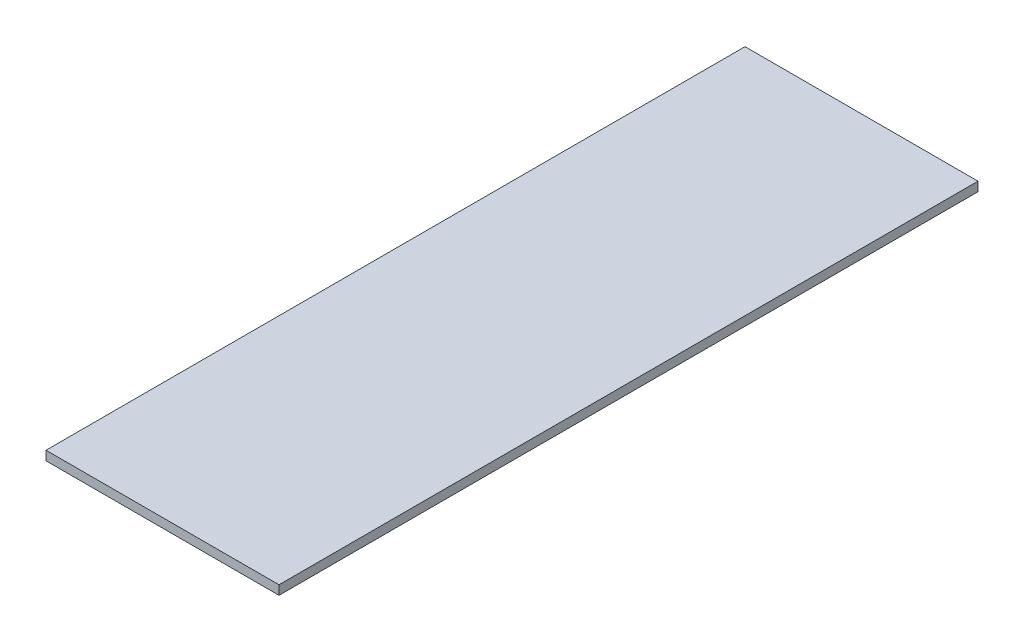
ISO-10303-21;
HEADER;
FILE_DESCRIPTION(('STEP AP214'),'2;1');
FILE_NAME('part.step','',(''),(''),'','','');
FILE_SCHEMA(('AUTOMOTIVE_DESIGN { 1 0 10303 214 1 1 1 1 }'));
ENDSEC;
DATA;
#1=APPLICATION_CONTEXT('core data for automotive mechanical design processes');
#2=APPLICATION_PROTOCOL_DEFINITION('international standard','automotive_design',2000,#1);
#3=PRODUCT_CONTEXT('',#1,'mechanical');
#4=PRODUCT('Part','Part','',(#3));
#5=PRODUCT_RELATED_PRODUCT_CATEGORY('part','',(#4));
#6=PRODUCT_DEFINITION_FORMATION('','',#4);
#7=PRODUCT_DEFINITION_CONTEXT('part definition',#1,'design');
#8=PRODUCT_DEFINITION('design','',#6,#7);
#9=PRODUCT_DEFINITION_SHAPE('','',#8);
#10=(LENGTH_UNIT() NAMED_UNIT(*) SI_UNIT(.MILLI.,.METRE.));
#11=(NAMED_UNIT(*) PLANE_ANGLE_UNIT() SI_UNIT($,.RADIAN.));
#12=(NAMED_UNIT(*) SI_UNIT($,.STERADIAN.) SOLID_ANGLE_UNIT());
#13=UNCERTAINTY_MEASURE_WITH_UNIT(LENGTH_MEASURE(1.E-05),#10,'distance_accuracy_value','');
#14=(GEOMETRIC_REPRESENTATION_CONTEXT(3) GLOBAL_UNCERTAINTY_ASSIGNED_CONTEXT((#13)) GLOBAL_UNIT_ASSIGNED_CONTEXT((#10,
#11,#12)) REPRESENTATION_CONTEXT('',''));
#15=CARTESIAN_POINT('',(0.,0.,0.));
#16=DIRECTION('',(0.,0.,1.));
#17=DIRECTION('',(1.,0.,0.));
#18=AXIS2_PLACEMENT_3D('',#15,#16,#17);
#19=CARTESIAN_POINT('',(0.,1.,0.));
#20=DIRECTION('',(1.,0.,0.));
#21=DIRECTION('',(0.,0.,-1.));
#22=AXIS2_PLACEMENT_3D('',#19,#20,#21);
#23=PLANE('',#22);
#24=DIRECTION('',(0.,0.,1.));
#25=VECTOR('',#24,1.);
#26=CARTESIAN_POINT('',(0.,0.,0.));
#27=LINE('',#26,#25);
#28=CARTESIAN_POINT('',(0.,0.,-76.2));
#29=VERTEX_POINT('',#28);
#30=CARTESIAN_POINT('',(0.,0.,0.));
#31=VERTEX_POINT('',#30);
#32=EDGE_CURVE('E95',#29,#31,#27,.T.);
#33=ORIENTED_EDGE('',*,*,#32,.T.);
#34=DIRECTION('',(0.,-1.,0.));
#35=VECTOR('',#34,1.);
#36=CARTESIAN_POINT('',(0.,1.,0.));
#37=LINE('',#36,#35);
#38=CARTESIAN_POINT('',(0.,1.,0.));
#39=VERTEX_POINT('',#38);
#40=EDGE_CURVE('E11',#39,#31,#37,.T.);
#41=ORIENTED_EDGE('',*,*,#40,.F.);
#42=DIRECTION('',(0.,0.,1.));
#43=VECTOR('',#42,1.);
#44=CARTESIAN_POINT('',(0.,1.,0.));
#45=LINE('',#44,#43);
#46=CARTESIAN_POINT('',(0.,1.,-76.2));
#47=VERTEX_POINT('',#46);
#48=EDGE_CURVE('E83',#47,#39,#45,.T.);
#49=ORIENTED_EDGE('',*,*,#48,.F.);
#50=DIRECTION('',(0.,-1.,0.));
#51=VECTOR('',#50,1.);
#52=CARTESIAN_POINT('',(0.,1.,-76.2));
#53=LINE('',#52,#51);
#54=EDGE_CURVE('E91',#47,#29,#53,.T.);
#55=ORIENTED_EDGE('',*,*,#54,.T.);
#56=EDGE_LOOP('',(#33,#41,#49,#55));
#57=FACE_BOUND('',#56,.T.);
#58=ADVANCED_FACE('F32',(#57),#23,.F.);
#59=CARTESIAN_POINT('',(0.,1.,0.));
#60=DIRECTION('',(0.,0.,-1.));
#61=DIRECTION('',(-1.,0.,0.));
#62=AXIS2_PLACEMENT_3D('',#59,#60,#61);
#63=PLANE('',#62);
#64=DIRECTION('',(1.,0.,0.));
#65=VECTOR('',#64,1.);
#66=CARTESIAN_POINT('',(0.,0.,0.));
#67=LINE('',#66,#65);
#68=CARTESIAN_POINT('',(25.4,0.,0.));
#69=VERTEX_POINT('',#68);
#70=EDGE_CURVE('E87',#31,#69,#67,.T.);
#71=ORIENTED_EDGE('',*,*,#70,.T.);
#72=DIRECTION('',(0.,-1.,0.));
#73=VECTOR('',#72,1.);
#74=CARTESIAN_POINT('',(25.4,1.,0.));
#75=LINE('',#74,#73);
#76=CARTESIAN_POINT('',(25.4,1.,0.));
#77=VERTEX_POINT('',#76);
#78=EDGE_CURVE('E40',#77,#69,#75,.T.);
#79=ORIENTED_EDGE('',*,*,#78,.F.);
#80=DIRECTION('',(1.,0.,0.));
#81=VECTOR('',#80,1.);
#82=CARTESIAN_POINT('',(0.,1.,0.));
#83=LINE('',#82,#81);
#84=EDGE_CURVE('E78',#39,#77,#83,.T.);
#85=ORIENTED_EDGE('',*,*,#84,.F.);
#86=ORIENTED_EDGE('',*,*,#40,.T.);
#87=EDGE_LOOP('',(#71,#79,#85,#86));
#88=FACE_BOUND('',#87,.T.);
#89=ADVANCED_FACE('F86',(#88),#63,.F.);
#90=CARTESIAN_POINT('',(25.4,1.,0.));
#91=DIRECTION('',(-1.,0.,0.));
#92=DIRECTION('',(0.,0.,1.));
#93=AXIS2_PLACEMENT_3D('',#90,#91,#92);
#94=PLANE('',#93);
#95=DIRECTION('',(0.,0.,-1.));
#96=VECTOR('',#95,1.);
#97=CARTESIAN_POINT('',(25.4,0.,0.));
#98=LINE('',#97,#96);
#99=CARTESIAN_POINT('',(25.4,0.,-76.2));
#100=VERTEX_POINT('',#99);
#101=EDGE_CURVE('E65',#69,#100,#98,.T.);
#102=ORIENTED_EDGE('',*,*,#101,.T.);
#103=DIRECTION('',(0.,-1.,0.));
#104=VECTOR('',#103,1.);
#105=CARTESIAN_POINT('',(25.4,1.,-76.2));
#106=LINE('',#105,#104);
#107=CARTESIAN_POINT('',(25.4,1.,-76.2));
#108=VERTEX_POINT('',#107);
#109=EDGE_CURVE('E88',#108,#100,#106,.T.);
#110=ORIENTED_EDGE('',*,*,#109,.F.);
#111=DIRECTION('',(0.,0.,-1.));
#112=VECTOR('',#111,1.);
#113=CARTESIAN_POINT('',(25.4,1.,0.));
#114=LINE('',#113,#112);
#115=EDGE_CURVE('E81',#77,#108,#114,.T.);
#116=ORIENTED_EDGE('',*,*,#115,.F.);
#117=ORIENTED_EDGE('',*,*,#78,.T.);
#118=EDGE_LOOP('',(#102,#110,#116,#117));
#119=FACE_BOUND('',#118,.T.);
#120=ADVANCED_FACE('F89',(#119),#94,.F.);
#121=CARTESIAN_POINT('',(0.,1.,-76.2));
#122=DIRECTION('',(0.,0.,1.));
#123=DIRECTION('',(1.,0.,0.));
#124=AXIS2_PLACEMENT_3D('',#121,#122,#123);
#125=PLANE('',#124);
#126=DIRECTION('',(-1.,0.,0.));
#127=VECTOR('',#126,1.);
#128=CARTESIAN_POINT('',(0.,0.,-76.2));
#129=LINE('',#128,#127);
#130=EDGE_CURVE('E71',#100,#29,#129,.T.);
#131=ORIENTED_EDGE('',*,*,#130,.T.);
#132=ORIENTED_EDGE('',*,*,#54,.F.);
#133=DIRECTION('',(-1.,0.,0.));
#134=VECTOR('',#133,1.);
#135=CARTESIAN_POINT('',(0.,1.,-76.2));
#136=LINE('',#135,#134);
#137=EDGE_CURVE('E48',#108,#47,#136,.T.);
#138=ORIENTED_EDGE('',*,*,#137,.F.);
#139=ORIENTED_EDGE('',*,*,#109,.T.);
#140=EDGE_LOOP('',(#131,#132,#138,#139));
#141=FACE_BOUND('',#140,.T.);
#142=ADVANCED_FACE('F102',(#141),#125,.F.);
#143=CARTESIAN_POINT('',(0.,1.,0.));
#144=DIRECTION('',(0.,-1.,0.));
#145=DIRECTION('',(0.,0.,-1.));
#146=AXIS2_PLACEMENT_3D('',#143,#144,#145);
#147=PLANE('',#146);
#148=ORIENTED_EDGE('',*,*,#48,.T.);
#149=ORIENTED_EDGE('',*,*,#84,.T.);
#150=ORIENTED_EDGE('',*,*,#115,.T.);
#151=ORIENTED_EDGE('',*,*,#137,.T.);
#152=EDGE_LOOP('',(#148,#149,#150,#151));
#153=FACE_BOUND('',#152,.T.);
#154=ADVANCED_FACE('F79',(#153),#147,.F.);
#155=CARTESIAN_POINT('',(0.,0.,0.));
#156=DIRECTION('',(0.,-1.,0.));
#157=DIRECTION('',(0.,0.,-1.));
#158=AXIS2_PLACEMENT_3D('',#155,#156,#157);
#159=PLANE('',#158);
#160=ORIENTED_EDGE('',*,*,#32,.F.);
#161=ORIENTED_EDGE('',*,*,#130,.F.);
#162=ORIENTED_EDGE('',*,*,#101,.F.);
#163=ORIENTED_EDGE('',*,*,#70,.F.);
#164=EDGE_LOOP('',(#160,#161,#162,#163));
#165=FACE_BOUND('',#164,.T.);
#166=ADVANCED_FACE('F105',(#165),#159,.T.);
#167=CLOSED_SHELL('',(#58,#89,#120,#142,#154,#166));
#168=MANIFOLD_SOLID_BREP('B2',#167);
#169=ADVANCED_BREP_SHAPE_REPRESENTATION('',(#18,#168),#14);
#170=SHAPE_DEFINITION_REPRESENTATION(#9,#169);
ENDSEC;
END-ISO-10303-21;
